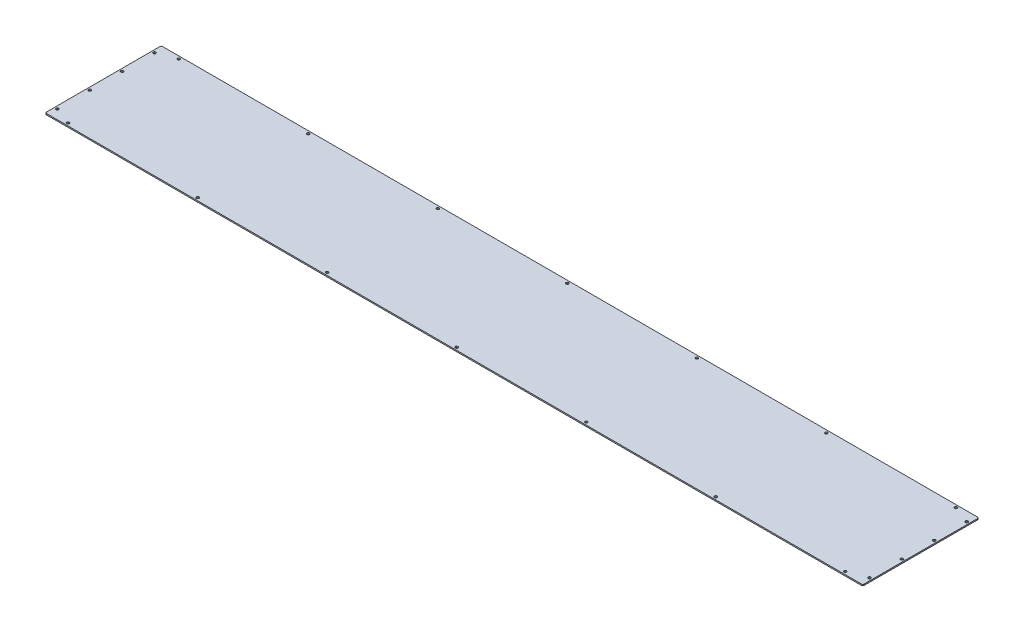
ISO-10303-21;
HEADER;
FILE_DESCRIPTION(('STEP AP214'),'2;1');
FILE_NAME('part.step','',(''),(''),'','','');
FILE_SCHEMA(('AUTOMOTIVE_DESIGN { 1 0 10303 214 1 1 1 1 }'));
ENDSEC;
DATA;
#1=APPLICATION_CONTEXT('core data for automotive mechanical design processes');
#2=APPLICATION_PROTOCOL_DEFINITION('international standard','automotive_design',2000,#1);
#3=PRODUCT_CONTEXT('',#1,'mechanical');
#4=PRODUCT('Part','Part','',(#3));
#5=PRODUCT_RELATED_PRODUCT_CATEGORY('part','',(#4));
#6=PRODUCT_DEFINITION_FORMATION('','',#4);
#7=PRODUCT_DEFINITION_CONTEXT('part definition',#1,'design');
#8=PRODUCT_DEFINITION('design','',#6,#7);
#9=PRODUCT_DEFINITION_SHAPE('','',#8);
#10=(LENGTH_UNIT() NAMED_UNIT(*) SI_UNIT(.MILLI.,.METRE.));
#11=(NAMED_UNIT(*) PLANE_ANGLE_UNIT() SI_UNIT($,.RADIAN.));
#12=(NAMED_UNIT(*) SI_UNIT($,.STERADIAN.) SOLID_ANGLE_UNIT());
#13=UNCERTAINTY_MEASURE_WITH_UNIT(LENGTH_MEASURE(1.E-05),#10,'distance_accuracy_value','');
#14=(GEOMETRIC_REPRESENTATION_CONTEXT(3) GLOBAL_UNCERTAINTY_ASSIGNED_CONTEXT((#13)) GLOBAL_UNIT_ASSIGNED_CONTEXT((#10,
#11,#12)) REPRESENTATION_CONTEXT('',''));
#15=CARTESIAN_POINT('',(0.,0.,0.));
#16=DIRECTION('',(0.,0.,1.));
#17=DIRECTION('',(1.,0.,0.));
#18=AXIS2_PLACEMENT_3D('',#15,#16,#17);
#19=CARTESIAN_POINT('',(962.025,2.9972,-136.525));
#20=DIRECTION('',(-1.,0.,0.));
#21=DIRECTION('',(0.,0.,1.));
#22=AXIS2_PLACEMENT_3D('',#19,#20,#21);
#23=PLANE('',#22);
#24=DIRECTION('',(0.,0.,-1.));
#25=VECTOR('',#24,1.);
#26=CARTESIAN_POINT('',(962.025,2.9972,-136.525));
#27=LINE('',#26,#25);
#28=CARTESIAN_POINT('',(962.025,2.9972,133.35));
#29=VERTEX_POINT('',#28);
#30=CARTESIAN_POINT('',(962.025,2.9972,-133.35));
#31=VERTEX_POINT('',#30);
#32=EDGE_CURVE('E121',#29,#31,#27,.T.);
#33=ORIENTED_EDGE('',*,*,#32,.F.);
#34=DIRECTION('',(0.,-1.,0.));
#35=VECTOR('',#34,1.);
#36=CARTESIAN_POINT('',(962.025,2.9972,133.35));
#37=LINE('',#36,#35);
#38=CARTESIAN_POINT('',(962.025,0.,133.35));
#39=VERTEX_POINT('',#38);
#40=EDGE_CURVE('E106',#29,#39,#37,.T.);
#41=ORIENTED_EDGE('',*,*,#40,.T.);
#42=DIRECTION('',(0.,0.,-1.));
#43=VECTOR('',#42,1.);
#44=CARTESIAN_POINT('',(962.025,0.,-136.525));
#45=LINE('',#44,#43);
#46=CARTESIAN_POINT('',(962.025,0.,-133.35));
#47=VERTEX_POINT('',#46);
#48=EDGE_CURVE('E118',#39,#47,#45,.T.);
#49=ORIENTED_EDGE('',*,*,#48,.T.);
#50=DIRECTION('',(0.,-1.,0.));
#51=VECTOR('',#50,1.);
#52=CARTESIAN_POINT('',(962.025,2.9972,-133.35));
#53=LINE('',#52,#51);
#54=EDGE_CURVE('E123',#47,#31,#53,.F.);
#55=ORIENTED_EDGE('',*,*,#54,.T.);
#56=EDGE_LOOP('',(#33,#41,#49,#55));
#57=FACE_BOUND('',#56,.T.);
#58=ADVANCED_FACE('F37',(#57),#23,.F.);
#59=CARTESIAN_POINT('',(-962.025,2.9972,-136.525));
#60=DIRECTION('',(0.,0.,1.));
#61=DIRECTION('',(1.,0.,0.));
#62=AXIS2_PLACEMENT_3D('',#59,#60,#61);
#63=PLANE('',#62);
#64=DIRECTION('',(-1.,0.,0.));
#65=VECTOR('',#64,1.);
#66=CARTESIAN_POINT('',(-962.025,2.9972,-136.525));
#67=LINE('',#66,#65);
#68=CARTESIAN_POINT('',(958.85,2.9972,-136.525));
#69=VERTEX_POINT('',#68);
#70=CARTESIAN_POINT('',(-958.85,2.9972,-136.525));
#71=VERTEX_POINT('',#70);
#72=EDGE_CURVE('E176',#69,#71,#67,.T.);
#73=ORIENTED_EDGE('',*,*,#72,.F.);
#74=DIRECTION('',(0.,-1.,0.));
#75=VECTOR('',#74,1.);
#76=CARTESIAN_POINT('',(958.85,2.9972,-136.525));
#77=LINE('',#76,#75);
#78=CARTESIAN_POINT('',(958.85,0.,-136.525));
#79=VERTEX_POINT('',#78);
#80=EDGE_CURVE('E160',#69,#79,#77,.T.);
#81=ORIENTED_EDGE('',*,*,#80,.T.);
#82=DIRECTION('',(-1.,0.,0.));
#83=VECTOR('',#82,1.);
#84=CARTESIAN_POINT('',(-962.025,0.,-136.525));
#85=LINE('',#84,#83);
#86=CARTESIAN_POINT('',(-958.85,0.,-136.525));
#87=VERTEX_POINT('',#86);
#88=EDGE_CURVE('E127',#79,#87,#85,.T.);
#89=ORIENTED_EDGE('',*,*,#88,.T.);
#90=DIRECTION('',(0.,-1.,0.));
#91=VECTOR('',#90,1.);
#92=CARTESIAN_POINT('',(-958.85,2.9972,-136.525));
#93=LINE('',#92,#91);
#94=EDGE_CURVE('E158',#87,#71,#93,.F.);
#95=ORIENTED_EDGE('',*,*,#94,.T.);
#96=EDGE_LOOP('',(#73,#81,#89,#95));
#97=FACE_BOUND('',#96,.T.);
#98=ADVANCED_FACE('F372',(#97),#63,.F.);
#99=CARTESIAN_POINT('',(-962.025,2.9972,-136.525));
#100=DIRECTION('',(1.,0.,0.));
#101=DIRECTION('',(0.,0.,-1.));
#102=AXIS2_PLACEMENT_3D('',#99,#100,#101);
#103=PLANE('',#102);
#104=DIRECTION('',(0.,0.,1.));
#105=VECTOR('',#104,1.);
#106=CARTESIAN_POINT('',(-962.025,0.,-136.525));
#107=LINE('',#106,#105);
#108=CARTESIAN_POINT('',(-962.025,0.,-133.35));
#109=VERTEX_POINT('',#108);
#110=CARTESIAN_POINT('',(-962.025,0.,133.35));
#111=VERTEX_POINT('',#110);
#112=EDGE_CURVE('E131',#109,#111,#107,.T.);
#113=ORIENTED_EDGE('',*,*,#112,.T.);
#114=DIRECTION('',(0.,-1.,0.));
#115=VECTOR('',#114,1.);
#116=CARTESIAN_POINT('',(-962.025,2.9972,133.35));
#117=LINE('',#116,#115);
#118=CARTESIAN_POINT('',(-962.025,2.9972,133.35));
#119=VERTEX_POINT('',#118);
#120=EDGE_CURVE('E11',#111,#119,#117,.F.);
#121=ORIENTED_EDGE('',*,*,#120,.T.);
#122=DIRECTION('',(0.,0.,1.));
#123=VECTOR('',#122,1.);
#124=CARTESIAN_POINT('',(-962.025,2.9972,-136.525));
#125=LINE('',#124,#123);
#126=CARTESIAN_POINT('',(-962.025,2.9972,-133.35));
#127=VERTEX_POINT('',#126);
#128=EDGE_CURVE('E166',#127,#119,#125,.T.);
#129=ORIENTED_EDGE('',*,*,#128,.F.);
#130=DIRECTION('',(0.,-1.,0.));
#131=VECTOR('',#130,1.);
#132=CARTESIAN_POINT('',(-962.025,2.9972,-133.35));
#133=LINE('',#132,#131);
#134=EDGE_CURVE('E45',#127,#109,#133,.T.);
#135=ORIENTED_EDGE('',*,*,#134,.T.);
#136=EDGE_LOOP('',(#113,#121,#129,#135));
#137=FACE_BOUND('',#136,.T.);
#138=ADVANCED_FACE('F165',(#137),#103,.F.);
#139=CARTESIAN_POINT('',(-962.025,2.9972,136.525));
#140=DIRECTION('',(0.,0.,-1.));
#141=DIRECTION('',(-1.,0.,0.));
#142=AXIS2_PLACEMENT_3D('',#139,#140,#141);
#143=PLANE('',#142);
#144=DIRECTION('',(1.,0.,0.));
#145=VECTOR('',#144,1.);
#146=CARTESIAN_POINT('',(-962.025,0.,136.525));
#147=LINE('',#146,#145);
#148=CARTESIAN_POINT('',(-958.85,0.,136.525));
#149=VERTEX_POINT('',#148);
#150=CARTESIAN_POINT('',(958.849999999999,0.,136.525));
#151=VERTEX_POINT('',#150);
#152=EDGE_CURVE('E141',#149,#151,#147,.T.);
#153=ORIENTED_EDGE('',*,*,#152,.T.);
#154=DIRECTION('',(0.,-1.,0.));
#155=VECTOR('',#154,1.);
#156=CARTESIAN_POINT('',(958.85,2.9972,136.525));
#157=LINE('',#156,#155);
#158=CARTESIAN_POINT('',(958.849999999999,2.9972,136.525));
#159=VERTEX_POINT('',#158);
#160=EDGE_CURVE('E107',#151,#159,#157,.F.);
#161=ORIENTED_EDGE('',*,*,#160,.T.);
#162=DIRECTION('',(1.,0.,0.));
#163=VECTOR('',#162,1.);
#164=CARTESIAN_POINT('',(-962.025,2.9972,136.525));
#165=LINE('',#164,#163);
#166=CARTESIAN_POINT('',(-958.85,2.9972,136.525));
#167=VERTEX_POINT('',#166);
#168=EDGE_CURVE('E137',#167,#159,#165,.T.);
#169=ORIENTED_EDGE('',*,*,#168,.F.);
#170=DIRECTION('',(0.,-1.,0.));
#171=VECTOR('',#170,1.);
#172=CARTESIAN_POINT('',(-958.85,2.9972,136.525));
#173=LINE('',#172,#171);
#174=EDGE_CURVE('E112',#167,#149,#173,.T.);
#175=ORIENTED_EDGE('',*,*,#174,.T.);
#176=EDGE_LOOP('',(#153,#161,#169,#175));
#177=FACE_BOUND('',#176,.T.);
#178=ADVANCED_FACE('F174',(#177),#143,.F.);
#179=CARTESIAN_POINT('',(0.,2.9972,0.));
#180=DIRECTION('',(0.,1.,0.));
#181=DIRECTION('',(0.,0.,1.));
#182=AXIS2_PLACEMENT_3D('',#179,#180,#181);
#183=PLANE('',#182);
#184=CARTESIAN_POINT('',(0.,2.9972,130.175));
#185=DIRECTION('',(0.,1.,0.));
#186=DIRECTION('',(0.,0.,1.));
#187=AXIS2_PLACEMENT_3D('',#184,#185,#186);
#188=CIRCLE('',#187,3.17499999999999);
#189=CARTESIAN_POINT('',(0.,2.9972,133.35));
#190=VERTEX_POINT('',#189);
#191=EDGE_CURVE('E305',#190,#190,#188,.T.);
#192=ORIENTED_EDGE('',*,*,#191,.F.);
#193=EDGE_LOOP('',(#192));
#194=FACE_BOUND('',#193,.T.);
#195=CARTESIAN_POINT('',(-955.675000000001,2.9972,-38.1));
#196=DIRECTION('',(0.,1.,0.));
#197=DIRECTION('',(0.,0.,1.));
#198=AXIS2_PLACEMENT_3D('',#195,#196,#197);
#199=CIRCLE('',#198,3.17500000000004);
#200=CARTESIAN_POINT('',(-955.675000000001,2.9972,-34.925));
#201=VERTEX_POINT('',#200);
#202=EDGE_CURVE('E299',#201,#201,#199,.T.);
#203=ORIENTED_EDGE('',*,*,#202,.F.);
#204=EDGE_LOOP('',(#203));
#205=FACE_BOUND('',#204,.T.);
#206=CARTESIAN_POINT('',(-955.675000000001,2.9972,38.1));
#207=DIRECTION('',(0.,1.,0.));
#208=DIRECTION('',(0.,0.,1.));
#209=AXIS2_PLACEMENT_3D('',#206,#207,#208);
#210=CIRCLE('',#209,3.17500000000004);
#211=CARTESIAN_POINT('',(-955.675000000001,2.9972,41.275));
#212=VERTEX_POINT('',#211);
#213=EDGE_CURVE('E293',#212,#212,#210,.T.);
#214=ORIENTED_EDGE('',*,*,#213,.F.);
#215=EDGE_LOOP('',(#214));
#216=FACE_BOUND('',#215,.T.);
#217=CARTESIAN_POINT('',(-914.4,2.9972,130.175));
#218=DIRECTION('',(0.,1.,0.));
#219=DIRECTION('',(0.,0.,1.));
#220=AXIS2_PLACEMENT_3D('',#217,#218,#219);
#221=CIRCLE('',#220,3.17500000000004);
#222=CARTESIAN_POINT('',(-914.4,2.9972,133.35));
#223=VERTEX_POINT('',#222);
#224=EDGE_CURVE('E287',#223,#223,#221,.T.);
#225=ORIENTED_EDGE('',*,*,#224,.F.);
#226=EDGE_LOOP('',(#225));
#227=FACE_BOUND('',#226,.T.);
#228=CARTESIAN_POINT('',(-609.6,2.9972,130.175));
#229=DIRECTION('',(0.,1.,0.));
#230=DIRECTION('',(0.,0.,1.));
#231=AXIS2_PLACEMENT_3D('',#228,#229,#230);
#232=CIRCLE('',#231,3.17500000000004);
#233=CARTESIAN_POINT('',(-609.6,2.9972,133.35));
#234=VERTEX_POINT('',#233);
#235=EDGE_CURVE('E281',#234,#234,#232,.T.);
#236=ORIENTED_EDGE('',*,*,#235,.F.);
#237=EDGE_LOOP('',(#236));
#238=FACE_BOUND('',#237,.T.);
#239=CARTESIAN_POINT('',(-304.8,2.9972,130.175));
#240=DIRECTION('',(0.,1.,0.));
#241=DIRECTION('',(0.,0.,1.));
#242=AXIS2_PLACEMENT_3D('',#239,#240,#241);
#243=CIRCLE('',#242,3.17499999999998);
#244=CARTESIAN_POINT('',(-304.8,2.9972,133.35));
#245=VERTEX_POINT('',#244);
#246=EDGE_CURVE('E275',#245,#245,#243,.T.);
#247=ORIENTED_EDGE('',*,*,#246,.F.);
#248=EDGE_LOOP('',(#247));
#249=FACE_BOUND('',#248,.T.);
#250=CARTESIAN_POINT('',(304.8,2.9972,130.175));
#251=DIRECTION('',(0.,1.,0.));
#252=DIRECTION('',(0.,0.,1.));
#253=AXIS2_PLACEMENT_3D('',#250,#251,#252);
#254=CIRCLE('',#253,3.17499999999998);
#255=CARTESIAN_POINT('',(304.8,2.9972,133.35));
#256=VERTEX_POINT('',#255);
#257=EDGE_CURVE('E269',#256,#256,#254,.T.);
#258=ORIENTED_EDGE('',*,*,#257,.F.);
#259=EDGE_LOOP('',(#258));
#260=FACE_BOUND('',#259,.T.);
#261=CARTESIAN_POINT('',(609.6,2.9972,130.175));
#262=DIRECTION('',(0.,1.,0.));
#263=DIRECTION('',(0.,0.,1.));
#264=AXIS2_PLACEMENT_3D('',#261,#262,#263);
#265=CIRCLE('',#264,3.17500000000004);
#266=CARTESIAN_POINT('',(609.6,2.9972,133.35));
#267=VERTEX_POINT('',#266);
#268=EDGE_CURVE('E263',#267,#267,#265,.T.);
#269=ORIENTED_EDGE('',*,*,#268,.F.);
#270=EDGE_LOOP('',(#269));
#271=FACE_BOUND('',#270,.T.);
#272=CARTESIAN_POINT('',(914.4,2.9972,130.175));
#273=DIRECTION('',(0.,1.,0.));
#274=DIRECTION('',(0.,0.,1.));
#275=AXIS2_PLACEMENT_3D('',#272,#273,#274);
#276=CIRCLE('',#275,3.17500000000004);
#277=CARTESIAN_POINT('',(914.4,2.9972,133.35));
#278=VERTEX_POINT('',#277);
#279=EDGE_CURVE('E257',#278,#278,#276,.T.);
#280=ORIENTED_EDGE('',*,*,#279,.F.);
#281=EDGE_LOOP('',(#280));
#282=FACE_BOUND('',#281,.T.);
#283=CARTESIAN_POINT('',(-955.675000000001,2.9972,114.3));
#284=DIRECTION('',(0.,1.,0.));
#285=DIRECTION('',(0.,0.,1.));
#286=AXIS2_PLACEMENT_3D('',#283,#284,#285);
#287=CIRCLE('',#286,3.17500000000004);
#288=CARTESIAN_POINT('',(-955.675000000001,2.9972,117.475));
#289=VERTEX_POINT('',#288);
#290=EDGE_CURVE('E251',#289,#289,#287,.T.);
#291=ORIENTED_EDGE('',*,*,#290,.F.);
#292=EDGE_LOOP('',(#291));
#293=FACE_BOUND('',#292,.T.);
#294=CARTESIAN_POINT('',(914.4,2.9972,-130.175));
#295=DIRECTION('',(0.,1.,0.));
#296=DIRECTION('',(0.,0.,1.));
#297=AXIS2_PLACEMENT_3D('',#294,#295,#296);
#298=CIRCLE('',#297,3.17500000000004);
#299=CARTESIAN_POINT('',(914.4,2.9972,-127.));
#300=VERTEX_POINT('',#299);
#301=EDGE_CURVE('E245',#300,#300,#298,.T.);
#302=ORIENTED_EDGE('',*,*,#301,.F.);
#303=EDGE_LOOP('',(#302));
#304=FACE_BOUND('',#303,.T.);
#305=CARTESIAN_POINT('',(609.6,2.9972,-130.175));
#306=DIRECTION('',(0.,1.,0.));
#307=DIRECTION('',(0.,0.,1.));
#308=AXIS2_PLACEMENT_3D('',#305,#306,#307);
#309=CIRCLE('',#308,3.17500000000004);
#310=CARTESIAN_POINT('',(609.6,2.9972,-127.));
#311=VERTEX_POINT('',#310);
#312=EDGE_CURVE('E239',#311,#311,#309,.T.);
#313=ORIENTED_EDGE('',*,*,#312,.F.);
#314=EDGE_LOOP('',(#313));
#315=FACE_BOUND('',#314,.T.);
#316=CARTESIAN_POINT('',(304.8,2.9972,-130.175));
#317=DIRECTION('',(0.,1.,0.));
#318=DIRECTION('',(0.,0.,1.));
#319=AXIS2_PLACEMENT_3D('',#316,#317,#318);
#320=CIRCLE('',#319,3.17499999999998);
#321=CARTESIAN_POINT('',(304.8,2.9972,-127.));
#322=VERTEX_POINT('',#321);
#323=EDGE_CURVE('E233',#322,#322,#320,.T.);
#324=ORIENTED_EDGE('',*,*,#323,.F.);
#325=EDGE_LOOP('',(#324));
#326=FACE_BOUND('',#325,.T.);
#327=CARTESIAN_POINT('',(-304.8,2.9972,-130.175));
#328=DIRECTION('',(0.,1.,0.));
#329=DIRECTION('',(0.,0.,1.));
#330=AXIS2_PLACEMENT_3D('',#327,#328,#329);
#331=CIRCLE('',#330,3.17499999999998);
#332=CARTESIAN_POINT('',(-304.8,2.9972,-127.));
#333=VERTEX_POINT('',#332);
#334=EDGE_CURVE('E227',#333,#333,#331,.T.);
#335=ORIENTED_EDGE('',*,*,#334,.F.);
#336=EDGE_LOOP('',(#335));
#337=FACE_BOUND('',#336,.T.);
#338=CARTESIAN_POINT('',(-609.6,2.9972,-130.175));
#339=DIRECTION('',(0.,1.,0.));
#340=DIRECTION('',(0.,0.,1.));
#341=AXIS2_PLACEMENT_3D('',#338,#339,#340);
#342=CIRCLE('',#341,3.17500000000004);
#343=CARTESIAN_POINT('',(-609.6,2.9972,-127.));
#344=VERTEX_POINT('',#343);
#345=EDGE_CURVE('E221',#344,#344,#342,.T.);
#346=ORIENTED_EDGE('',*,*,#345,.F.);
#347=EDGE_LOOP('',(#346));
#348=FACE_BOUND('',#347,.T.);
#349=CARTESIAN_POINT('',(-914.4,2.9972,-130.175));
#350=DIRECTION('',(0.,1.,0.));
#351=DIRECTION('',(0.,0.,1.));
#352=AXIS2_PLACEMENT_3D('',#349,#350,#351);
#353=CIRCLE('',#352,3.17500000000004);
#354=CARTESIAN_POINT('',(-914.4,2.9972,-127.));
#355=VERTEX_POINT('',#354);
#356=EDGE_CURVE('E215',#355,#355,#353,.T.);
#357=ORIENTED_EDGE('',*,*,#356,.F.);
#358=EDGE_LOOP('',(#357));
#359=FACE_BOUND('',#358,.T.);
#360=CARTESIAN_POINT('',(0.,2.9972,-130.175));
#361=DIRECTION('',(0.,1.,0.));
#362=DIRECTION('',(0.,0.,1.));
#363=AXIS2_PLACEMENT_3D('',#360,#361,#362);
#364=CIRCLE('',#363,3.17499999999999);
#365=CARTESIAN_POINT('',(0.,2.9972,-127.));
#366=VERTEX_POINT('',#365);
#367=EDGE_CURVE('E209',#366,#366,#364,.T.);
#368=ORIENTED_EDGE('',*,*,#367,.F.);
#369=EDGE_LOOP('',(#368));
#370=FACE_BOUND('',#369,.T.);
#371=CARTESIAN_POINT('',(955.675000000001,2.9972,114.3));
#372=DIRECTION('',(0.,1.,0.));
#373=DIRECTION('',(0.,0.,1.));
#374=AXIS2_PLACEMENT_3D('',#371,#372,#373);
#375=CIRCLE('',#374,3.17500000000004);
#376=CARTESIAN_POINT('',(955.675000000001,2.9972,117.475));
#377=VERTEX_POINT('',#376);
#378=EDGE_CURVE('E203',#377,#377,#375,.T.);
#379=ORIENTED_EDGE('',*,*,#378,.F.);
#380=EDGE_LOOP('',(#379));
#381=FACE_BOUND('',#380,.T.);
#382=CARTESIAN_POINT('',(955.675000000001,2.9972,38.0999999999998));
#383=DIRECTION('',(0.,1.,0.));
#384=DIRECTION('',(0.,0.,1.));
#385=AXIS2_PLACEMENT_3D('',#382,#383,#384);
#386=CIRCLE('',#385,3.17500000000004);
#387=CARTESIAN_POINT('',(955.675000000001,2.9972,41.2749999999998));
#388=VERTEX_POINT('',#387);
#389=EDGE_CURVE('E197',#388,#388,#386,.T.);
#390=ORIENTED_EDGE('',*,*,#389,.F.);
#391=EDGE_LOOP('',(#390));
#392=FACE_BOUND('',#391,.T.);
#393=CARTESIAN_POINT('',(955.675000000001,2.9972,-38.1000000000003));
#394=DIRECTION('',(0.,1.,0.));
#395=DIRECTION('',(0.,0.,1.));
#396=AXIS2_PLACEMENT_3D('',#393,#394,#395);
#397=CIRCLE('',#396,3.17500000000004);
#398=CARTESIAN_POINT('',(955.675000000001,2.9972,-34.9250000000002));
#399=VERTEX_POINT('',#398);
#400=EDGE_CURVE('E191',#399,#399,#397,.T.);
#401=ORIENTED_EDGE('',*,*,#400,.F.);
#402=EDGE_LOOP('',(#401));
#403=FACE_BOUND('',#402,.T.);
#404=CARTESIAN_POINT('',(-955.675000000001,2.9972,-114.3));
#405=DIRECTION('',(0.,1.,0.));
#406=DIRECTION('',(0.,0.,1.));
#407=AXIS2_PLACEMENT_3D('',#404,#405,#406);
#408=CIRCLE('',#407,3.17500000000004);
#409=CARTESIAN_POINT('',(-955.675000000001,2.9972,-111.125));
#410=VERTEX_POINT('',#409);
#411=EDGE_CURVE('E185',#410,#410,#408,.T.);
#412=ORIENTED_EDGE('',*,*,#411,.F.);
#413=EDGE_LOOP('',(#412));
#414=FACE_BOUND('',#413,.T.);
#415=CARTESIAN_POINT('',(955.675000000001,2.9972,-114.3));
#416=DIRECTION('',(0.,1.,0.));
#417=DIRECTION('',(0.,0.,1.));
#418=AXIS2_PLACEMENT_3D('',#415,#416,#417);
#419=CIRCLE('',#418,3.17500000000004);
#420=CARTESIAN_POINT('',(955.675000000001,2.9972,-111.125));
#421=VERTEX_POINT('',#420);
#422=EDGE_CURVE('E134',#421,#421,#419,.T.);
#423=ORIENTED_EDGE('',*,*,#422,.F.);
#424=EDGE_LOOP('',(#423));
#425=FACE_BOUND('',#424,.T.);
#426=ORIENTED_EDGE('',*,*,#168,.T.);
#427=CARTESIAN_POINT('',(958.85,2.9972,133.35));
#428=DIRECTION('',(0.,1.,0.));
#429=DIRECTION('',(0.,0.,1.));
#430=AXIS2_PLACEMENT_3D('',#427,#428,#429);
#431=CIRCLE('',#430,3.175);
#432=EDGE_CURVE('E156',#159,#29,#431,.T.);
#433=ORIENTED_EDGE('',*,*,#432,.T.);
#434=ORIENTED_EDGE('',*,*,#32,.T.);
#435=CARTESIAN_POINT('',(958.85,2.9972,-133.35));
#436=DIRECTION('',(0.,1.,0.));
#437=DIRECTION('',(0.,0.,1.));
#438=AXIS2_PLACEMENT_3D('',#435,#436,#437);
#439=CIRCLE('',#438,3.175);
#440=EDGE_CURVE('E154',#31,#69,#439,.T.);
#441=ORIENTED_EDGE('',*,*,#440,.T.);
#442=ORIENTED_EDGE('',*,*,#72,.T.);
#443=CARTESIAN_POINT('',(-958.85,2.9972,-133.35));
#444=DIRECTION('',(0.,1.,0.));
#445=DIRECTION('',(0.,0.,1.));
#446=AXIS2_PLACEMENT_3D('',#443,#444,#445);
#447=CIRCLE('',#446,3.175);
#448=EDGE_CURVE('E57',#71,#127,#447,.T.);
#449=ORIENTED_EDGE('',*,*,#448,.T.);
#450=ORIENTED_EDGE('',*,*,#128,.T.);
#451=CARTESIAN_POINT('',(-958.85,2.9972,133.35));
#452=DIRECTION('',(0.,1.,0.));
#453=DIRECTION('',(0.,0.,1.));
#454=AXIS2_PLACEMENT_3D('',#451,#452,#453);
#455=CIRCLE('',#454,3.175);
#456=EDGE_CURVE('E152',#119,#167,#455,.T.);
#457=ORIENTED_EDGE('',*,*,#456,.T.);
#458=EDGE_LOOP('',(#426,#433,#434,#441,#442,#449,#450,#457));
#459=FACE_BOUND('',#458,.T.);
#460=ADVANCED_FACE('F311',(#194,#205,#216,#227,#238,#249,#260,#271,#282,#293,#304,#315,#326,
#337,#348,#359,#370,#381,#392,#403,#414,#425,#459),#183,.T.);
#461=CARTESIAN_POINT('',(0.,0.,0.));
#462=DIRECTION('',(0.,1.,0.));
#463=DIRECTION('',(0.,0.,1.));
#464=AXIS2_PLACEMENT_3D('',#461,#462,#463);
#465=PLANE('',#464);
#466=CARTESIAN_POINT('',(0.,0.,130.175));
#467=DIRECTION('',(0.,1.,0.));
#468=DIRECTION('',(0.,0.,1.));
#469=AXIS2_PLACEMENT_3D('',#466,#467,#468);
#470=CIRCLE('',#469,3.175);
#471=CARTESIAN_POINT('',(0.,0.,133.35));
#472=VERTEX_POINT('',#471);
#473=EDGE_CURVE('E302',#472,#472,#470,.T.);
#474=ORIENTED_EDGE('',*,*,#473,.T.);
#475=EDGE_LOOP('',(#474));
#476=FACE_BOUND('',#475,.T.);
#477=CARTESIAN_POINT('',(-955.675000000001,0.,-38.1));
#478=DIRECTION('',(0.,1.,0.));
#479=DIRECTION('',(0.,0.,1.));
#480=AXIS2_PLACEMENT_3D('',#477,#478,#479);
#481=CIRCLE('',#480,3.17500000000004);
#482=CARTESIAN_POINT('',(-955.675000000001,0.,-34.925));
#483=VERTEX_POINT('',#482);
#484=EDGE_CURVE('E296',#483,#483,#481,.T.);
#485=ORIENTED_EDGE('',*,*,#484,.T.);
#486=EDGE_LOOP('',(#485));
#487=FACE_BOUND('',#486,.T.);
#488=CARTESIAN_POINT('',(-955.675000000001,0.,38.1));
#489=DIRECTION('',(0.,1.,0.));
#490=DIRECTION('',(0.,0.,1.));
#491=AXIS2_PLACEMENT_3D('',#488,#489,#490);
#492=CIRCLE('',#491,3.17500000000004);
#493=CARTESIAN_POINT('',(-955.675000000001,0.,41.275));
#494=VERTEX_POINT('',#493);
#495=EDGE_CURVE('E290',#494,#494,#492,.T.);
#496=ORIENTED_EDGE('',*,*,#495,.T.);
#497=EDGE_LOOP('',(#496));
#498=FACE_BOUND('',#497,.T.);
#499=CARTESIAN_POINT('',(-914.4,0.,130.175));
#500=DIRECTION('',(0.,1.,0.));
#501=DIRECTION('',(0.,0.,1.));
#502=AXIS2_PLACEMENT_3D('',#499,#500,#501);
#503=CIRCLE('',#502,3.17500000000004);
#504=CARTESIAN_POINT('',(-914.4,0.,133.35));
#505=VERTEX_POINT('',#504);
#506=EDGE_CURVE('E284',#505,#505,#503,.T.);
#507=ORIENTED_EDGE('',*,*,#506,.T.);
#508=EDGE_LOOP('',(#507));
#509=FACE_BOUND('',#508,.T.);
#510=CARTESIAN_POINT('',(-609.6,0.,130.175));
#511=DIRECTION('',(0.,1.,0.));
#512=DIRECTION('',(0.,0.,1.));
#513=AXIS2_PLACEMENT_3D('',#510,#511,#512);
#514=CIRCLE('',#513,3.17500000000004);
#515=CARTESIAN_POINT('',(-609.6,0.,133.35));
#516=VERTEX_POINT('',#515);
#517=EDGE_CURVE('E278',#516,#516,#514,.T.);
#518=ORIENTED_EDGE('',*,*,#517,.T.);
#519=EDGE_LOOP('',(#518));
#520=FACE_BOUND('',#519,.T.);
#521=CARTESIAN_POINT('',(-304.8,0.,130.175));
#522=DIRECTION('',(0.,1.,0.));
#523=DIRECTION('',(0.,0.,1.));
#524=AXIS2_PLACEMENT_3D('',#521,#522,#523);
#525=CIRCLE('',#524,3.17499999999998);
#526=CARTESIAN_POINT('',(-304.8,0.,133.35));
#527=VERTEX_POINT('',#526);
#528=EDGE_CURVE('E272',#527,#527,#525,.T.);
#529=ORIENTED_EDGE('',*,*,#528,.T.);
#530=EDGE_LOOP('',(#529));
#531=FACE_BOUND('',#530,.T.);
#532=CARTESIAN_POINT('',(304.8,0.,130.175));
#533=DIRECTION('',(0.,1.,0.));
#534=DIRECTION('',(0.,0.,1.));
#535=AXIS2_PLACEMENT_3D('',#532,#533,#534);
#536=CIRCLE('',#535,3.17499999999998);
#537=CARTESIAN_POINT('',(304.8,0.,133.35));
#538=VERTEX_POINT('',#537);
#539=EDGE_CURVE('E266',#538,#538,#536,.T.);
#540=ORIENTED_EDGE('',*,*,#539,.T.);
#541=EDGE_LOOP('',(#540));
#542=FACE_BOUND('',#541,.T.);
#543=CARTESIAN_POINT('',(609.6,0.,130.175));
#544=DIRECTION('',(0.,1.,0.));
#545=DIRECTION('',(0.,0.,1.));
#546=AXIS2_PLACEMENT_3D('',#543,#544,#545);
#547=CIRCLE('',#546,3.17500000000004);
#548=CARTESIAN_POINT('',(609.6,0.,133.35));
#549=VERTEX_POINT('',#548);
#550=EDGE_CURVE('E260',#549,#549,#547,.T.);
#551=ORIENTED_EDGE('',*,*,#550,.T.);
#552=EDGE_LOOP('',(#551));
#553=FACE_BOUND('',#552,.T.);
#554=CARTESIAN_POINT('',(914.4,0.,130.175));
#555=DIRECTION('',(0.,1.,0.));
#556=DIRECTION('',(0.,0.,1.));
#557=AXIS2_PLACEMENT_3D('',#554,#555,#556);
#558=CIRCLE('',#557,3.17500000000004);
#559=CARTESIAN_POINT('',(914.4,0.,133.35));
#560=VERTEX_POINT('',#559);
#561=EDGE_CURVE('E254',#560,#560,#558,.T.);
#562=ORIENTED_EDGE('',*,*,#561,.T.);
#563=EDGE_LOOP('',(#562));
#564=FACE_BOUND('',#563,.T.);
#565=CARTESIAN_POINT('',(-955.675000000001,0.,114.3));
#566=DIRECTION('',(0.,1.,0.));
#567=DIRECTION('',(0.,0.,1.));
#568=AXIS2_PLACEMENT_3D('',#565,#566,#567);
#569=CIRCLE('',#568,3.17500000000004);
#570=CARTESIAN_POINT('',(-955.675000000001,0.,117.475));
#571=VERTEX_POINT('',#570);
#572=EDGE_CURVE('E248',#571,#571,#569,.T.);
#573=ORIENTED_EDGE('',*,*,#572,.T.);
#574=EDGE_LOOP('',(#573));
#575=FACE_BOUND('',#574,.T.);
#576=CARTESIAN_POINT('',(914.4,0.,-130.175));
#577=DIRECTION('',(0.,1.,0.));
#578=DIRECTION('',(0.,0.,1.));
#579=AXIS2_PLACEMENT_3D('',#576,#577,#578);
#580=CIRCLE('',#579,3.17500000000004);
#581=CARTESIAN_POINT('',(914.4,0.,-127.));
#582=VERTEX_POINT('',#581);
#583=EDGE_CURVE('E242',#582,#582,#580,.T.);
#584=ORIENTED_EDGE('',*,*,#583,.T.);
#585=EDGE_LOOP('',(#584));
#586=FACE_BOUND('',#585,.T.);
#587=CARTESIAN_POINT('',(609.6,0.,-130.175));
#588=DIRECTION('',(0.,1.,0.));
#589=DIRECTION('',(0.,0.,1.));
#590=AXIS2_PLACEMENT_3D('',#587,#588,#589);
#591=CIRCLE('',#590,3.17500000000004);
#592=CARTESIAN_POINT('',(609.6,0.,-127.));
#593=VERTEX_POINT('',#592);
#594=EDGE_CURVE('E236',#593,#593,#591,.T.);
#595=ORIENTED_EDGE('',*,*,#594,.T.);
#596=EDGE_LOOP('',(#595));
#597=FACE_BOUND('',#596,.T.);
#598=CARTESIAN_POINT('',(304.8,0.,-130.175));
#599=DIRECTION('',(0.,1.,0.));
#600=DIRECTION('',(0.,0.,1.));
#601=AXIS2_PLACEMENT_3D('',#598,#599,#600);
#602=CIRCLE('',#601,3.17499999999998);
#603=CARTESIAN_POINT('',(304.8,0.,-127.));
#604=VERTEX_POINT('',#603);
#605=EDGE_CURVE('E230',#604,#604,#602,.T.);
#606=ORIENTED_EDGE('',*,*,#605,.T.);
#607=EDGE_LOOP('',(#606));
#608=FACE_BOUND('',#607,.T.);
#609=CARTESIAN_POINT('',(-304.8,0.,-130.175));
#610=DIRECTION('',(0.,1.,0.));
#611=DIRECTION('',(0.,0.,1.));
#612=AXIS2_PLACEMENT_3D('',#609,#610,#611);
#613=CIRCLE('',#612,3.17499999999998);
#614=CARTESIAN_POINT('',(-304.8,0.,-127.));
#615=VERTEX_POINT('',#614);
#616=EDGE_CURVE('E224',#615,#615,#613,.T.);
#617=ORIENTED_EDGE('',*,*,#616,.T.);
#618=EDGE_LOOP('',(#617));
#619=FACE_BOUND('',#618,.T.);
#620=CARTESIAN_POINT('',(-609.6,0.,-130.175));
#621=DIRECTION('',(0.,1.,0.));
#622=DIRECTION('',(0.,0.,1.));
#623=AXIS2_PLACEMENT_3D('',#620,#621,#622);
#624=CIRCLE('',#623,3.17500000000004);
#625=CARTESIAN_POINT('',(-609.6,0.,-127.));
#626=VERTEX_POINT('',#625);
#627=EDGE_CURVE('E218',#626,#626,#624,.T.);
#628=ORIENTED_EDGE('',*,*,#627,.T.);
#629=EDGE_LOOP('',(#628));
#630=FACE_BOUND('',#629,.T.);
#631=CARTESIAN_POINT('',(-914.4,0.,-130.175));
#632=DIRECTION('',(0.,1.,0.));
#633=DIRECTION('',(0.,0.,1.));
#634=AXIS2_PLACEMENT_3D('',#631,#632,#633);
#635=CIRCLE('',#634,3.17500000000004);
#636=CARTESIAN_POINT('',(-914.4,0.,-127.));
#637=VERTEX_POINT('',#636);
#638=EDGE_CURVE('E212',#637,#637,#635,.T.);
#639=ORIENTED_EDGE('',*,*,#638,.T.);
#640=EDGE_LOOP('',(#639));
#641=FACE_BOUND('',#640,.T.);
#642=CARTESIAN_POINT('',(0.,0.,-130.175));
#643=DIRECTION('',(0.,1.,0.));
#644=DIRECTION('',(0.,0.,1.));
#645=AXIS2_PLACEMENT_3D('',#642,#643,#644);
#646=CIRCLE('',#645,3.175);
#647=CARTESIAN_POINT('',(0.,0.,-127.));
#648=VERTEX_POINT('',#647);
#649=EDGE_CURVE('E206',#648,#648,#646,.T.);
#650=ORIENTED_EDGE('',*,*,#649,.T.);
#651=EDGE_LOOP('',(#650));
#652=FACE_BOUND('',#651,.T.);
#653=CARTESIAN_POINT('',(955.675000000001,0.,114.3));
#654=DIRECTION('',(0.,1.,0.));
#655=DIRECTION('',(0.,0.,1.));
#656=AXIS2_PLACEMENT_3D('',#653,#654,#655);
#657=CIRCLE('',#656,3.17500000000004);
#658=CARTESIAN_POINT('',(955.675000000001,0.,117.475));
#659=VERTEX_POINT('',#658);
#660=EDGE_CURVE('E200',#659,#659,#657,.T.);
#661=ORIENTED_EDGE('',*,*,#660,.T.);
#662=EDGE_LOOP('',(#661));
#663=FACE_BOUND('',#662,.T.);
#664=CARTESIAN_POINT('',(955.675000000001,0.,38.0999999999998));
#665=DIRECTION('',(0.,1.,0.));
#666=DIRECTION('',(0.,0.,1.));
#667=AXIS2_PLACEMENT_3D('',#664,#665,#666);
#668=CIRCLE('',#667,3.17500000000004);
#669=CARTESIAN_POINT('',(955.675000000001,0.,41.2749999999998));
#670=VERTEX_POINT('',#669);
#671=EDGE_CURVE('E194',#670,#670,#668,.T.);
#672=ORIENTED_EDGE('',*,*,#671,.T.);
#673=EDGE_LOOP('',(#672));
#674=FACE_BOUND('',#673,.T.);
#675=CARTESIAN_POINT('',(955.675000000001,0.,-38.1000000000003));
#676=DIRECTION('',(0.,1.,0.));
#677=DIRECTION('',(0.,0.,1.));
#678=AXIS2_PLACEMENT_3D('',#675,#676,#677);
#679=CIRCLE('',#678,3.17500000000004);
#680=CARTESIAN_POINT('',(955.675000000001,0.,-34.9250000000002));
#681=VERTEX_POINT('',#680);
#682=EDGE_CURVE('E188',#681,#681,#679,.T.);
#683=ORIENTED_EDGE('',*,*,#682,.T.);
#684=EDGE_LOOP('',(#683));
#685=FACE_BOUND('',#684,.T.);
#686=CARTESIAN_POINT('',(-955.675000000001,0.,-114.3));
#687=DIRECTION('',(0.,1.,0.));
#688=DIRECTION('',(0.,0.,1.));
#689=AXIS2_PLACEMENT_3D('',#686,#687,#688);
#690=CIRCLE('',#689,3.17500000000004);
#691=CARTESIAN_POINT('',(-955.675000000001,0.,-111.125));
#692=VERTEX_POINT('',#691);
#693=EDGE_CURVE('E182',#692,#692,#690,.T.);
#694=ORIENTED_EDGE('',*,*,#693,.T.);
#695=EDGE_LOOP('',(#694));
#696=FACE_BOUND('',#695,.T.);
#697=CARTESIAN_POINT('',(955.675000000001,0.,-114.3));
#698=DIRECTION('',(0.,1.,0.));
#699=DIRECTION('',(0.,0.,1.));
#700=AXIS2_PLACEMENT_3D('',#697,#698,#699);
#701=CIRCLE('',#700,3.17500000000004);
#702=CARTESIAN_POINT('',(955.675000000001,0.,-111.125));
#703=VERTEX_POINT('',#702);
#704=EDGE_CURVE('E128',#703,#703,#701,.T.);
#705=ORIENTED_EDGE('',*,*,#704,.T.);
#706=EDGE_LOOP('',(#705));
#707=FACE_BOUND('',#706,.T.);
#708=ORIENTED_EDGE('',*,*,#48,.F.);
#709=CARTESIAN_POINT('',(958.85,0.,133.35));
#710=DIRECTION('',(0.,1.,0.));
#711=DIRECTION('',(0.,0.,1.));
#712=AXIS2_PLACEMENT_3D('',#709,#710,#711);
#713=CIRCLE('',#712,3.175);
#714=EDGE_CURVE('E102',#39,#151,#713,.F.);
#715=ORIENTED_EDGE('',*,*,#714,.T.);
#716=ORIENTED_EDGE('',*,*,#152,.F.);
#717=CARTESIAN_POINT('',(-958.85,0.,133.35));
#718=DIRECTION('',(0.,1.,0.));
#719=DIRECTION('',(0.,0.,1.));
#720=AXIS2_PLACEMENT_3D('',#717,#718,#719);
#721=CIRCLE('',#720,3.175);
#722=EDGE_CURVE('E145',#149,#111,#721,.F.);
#723=ORIENTED_EDGE('',*,*,#722,.T.);
#724=ORIENTED_EDGE('',*,*,#112,.F.);
#725=CARTESIAN_POINT('',(-958.85,0.,-133.35));
#726=DIRECTION('',(0.,1.,0.));
#727=DIRECTION('',(0.,0.,1.));
#728=AXIS2_PLACEMENT_3D('',#725,#726,#727);
#729=CIRCLE('',#728,3.175);
#730=EDGE_CURVE('E122',#109,#87,#729,.F.);
#731=ORIENTED_EDGE('',*,*,#730,.T.);
#732=ORIENTED_EDGE('',*,*,#88,.F.);
#733=CARTESIAN_POINT('',(958.85,0.,-133.35));
#734=DIRECTION('',(0.,1.,0.));
#735=DIRECTION('',(0.,0.,1.));
#736=AXIS2_PLACEMENT_3D('',#733,#734,#735);
#737=CIRCLE('',#736,3.175);
#738=EDGE_CURVE('E113',#79,#47,#737,.F.);
#739=ORIENTED_EDGE('',*,*,#738,.T.);
#740=EDGE_LOOP('',(#708,#715,#716,#723,#724,#731,#732,#739));
#741=FACE_BOUND('',#740,.T.);
#742=ADVANCED_FACE('F125',(#476,#487,#498,#509,#520,#531,#542,#553,#564,#575,#586,#597,#608,
#619,#630,#641,#652,#663,#674,#685,#696,#707,#741),#465,.F.);
#743=CARTESIAN_POINT('',(958.85,2.9972,133.35));
#744=DIRECTION('',(0.,-1.,0.));
#745=DIRECTION('',(0.,0.,-1.));
#746=AXIS2_PLACEMENT_3D('',#743,#744,#745);
#747=CYLINDRICAL_SURFACE('',#746,3.175);
#748=ORIENTED_EDGE('',*,*,#432,.F.);
#749=ORIENTED_EDGE('',*,*,#160,.F.);
#750=ORIENTED_EDGE('',*,*,#714,.F.);
#751=ORIENTED_EDGE('',*,*,#40,.F.);
#752=EDGE_LOOP('',(#748,#749,#750,#751));
#753=FACE_BOUND('',#752,.T.);
#754=ADVANCED_FACE('F105',(#753),#747,.T.);
#755=CARTESIAN_POINT('',(958.85,2.9972,-133.35));
#756=DIRECTION('',(0.,-1.,0.));
#757=DIRECTION('',(0.,0.,-1.));
#758=AXIS2_PLACEMENT_3D('',#755,#756,#757);
#759=CYLINDRICAL_SURFACE('',#758,3.175);
#760=ORIENTED_EDGE('',*,*,#440,.F.);
#761=ORIENTED_EDGE('',*,*,#54,.F.);
#762=ORIENTED_EDGE('',*,*,#738,.F.);
#763=ORIENTED_EDGE('',*,*,#80,.F.);
#764=EDGE_LOOP('',(#760,#761,#762,#763));
#765=FACE_BOUND('',#764,.T.);
#766=ADVANCED_FACE('F383',(#765),#759,.T.);
#767=CARTESIAN_POINT('',(-958.85,2.9972,133.35));
#768=DIRECTION('',(0.,-1.,0.));
#769=DIRECTION('',(0.,0.,-1.));
#770=AXIS2_PLACEMENT_3D('',#767,#768,#769);
#771=CYLINDRICAL_SURFACE('',#770,3.175);
#772=ORIENTED_EDGE('',*,*,#456,.F.);
#773=ORIENTED_EDGE('',*,*,#120,.F.);
#774=ORIENTED_EDGE('',*,*,#722,.F.);
#775=ORIENTED_EDGE('',*,*,#174,.F.);
#776=EDGE_LOOP('',(#772,#773,#774,#775));
#777=FACE_BOUND('',#776,.T.);
#778=ADVANCED_FACE('F171',(#777),#771,.T.);
#779=CARTESIAN_POINT('',(-958.85,2.9972,-133.35));
#780=DIRECTION('',(0.,-1.,0.));
#781=DIRECTION('',(0.,0.,-1.));
#782=AXIS2_PLACEMENT_3D('',#779,#780,#781);
#783=CYLINDRICAL_SURFACE('',#782,3.175);
#784=ORIENTED_EDGE('',*,*,#448,.F.);
#785=ORIENTED_EDGE('',*,*,#94,.F.);
#786=ORIENTED_EDGE('',*,*,#730,.F.);
#787=ORIENTED_EDGE('',*,*,#134,.F.);
#788=EDGE_LOOP('',(#784,#785,#786,#787));
#789=FACE_BOUND('',#788,.T.);
#790=ADVANCED_FACE('F39',(#789),#783,.T.);
#791=CARTESIAN_POINT('',(955.675000000001,2.9972,-114.3));
#792=DIRECTION('',(0.,1.,0.));
#793=DIRECTION('',(0.,0.,1.));
#794=AXIS2_PLACEMENT_3D('',#791,#792,#793);
#795=CYLINDRICAL_SURFACE('',#794,3.17500000000004);
#796=ORIENTED_EDGE('',*,*,#704,.F.);
#797=EDGE_LOOP('',(#796));
#798=FACE_BOUND('',#797,.T.);
#799=ORIENTED_EDGE('',*,*,#422,.T.);
#800=EDGE_LOOP('',(#799));
#801=FACE_BOUND('',#800,.T.);
#802=ADVANCED_FACE('F357',(#798,#801),#795,.F.);
#803=CARTESIAN_POINT('',(-955.675000000001,2.9972,-114.3));
#804=DIRECTION('',(0.,1.,0.));
#805=DIRECTION('',(0.,0.,1.));
#806=AXIS2_PLACEMENT_3D('',#803,#804,#805);
#807=CYLINDRICAL_SURFACE('',#806,3.17500000000004);
#808=ORIENTED_EDGE('',*,*,#693,.F.);
#809=EDGE_LOOP('',(#808));
#810=FACE_BOUND('',#809,.T.);
#811=ORIENTED_EDGE('',*,*,#411,.T.);
#812=EDGE_LOOP('',(#811));
#813=FACE_BOUND('',#812,.T.);
#814=ADVANCED_FACE('F359',(#810,#813),#807,.F.);
#815=CARTESIAN_POINT('',(955.675000000001,2.9972,-38.1000000000003));
#816=DIRECTION('',(0.,1.,0.));
#817=DIRECTION('',(0.,0.,1.));
#818=AXIS2_PLACEMENT_3D('',#815,#816,#817);
#819=CYLINDRICAL_SURFACE('',#818,3.17500000000004);
#820=ORIENTED_EDGE('',*,*,#682,.F.);
#821=EDGE_LOOP('',(#820));
#822=FACE_BOUND('',#821,.T.);
#823=ORIENTED_EDGE('',*,*,#400,.T.);
#824=EDGE_LOOP('',(#823));
#825=FACE_BOUND('',#824,.T.);
#826=ADVANCED_FACE('F366',(#822,#825),#819,.F.);
#827=CARTESIAN_POINT('',(955.675000000001,2.9972,38.0999999999998));
#828=DIRECTION('',(0.,1.,0.));
#829=DIRECTION('',(0.,0.,1.));
#830=AXIS2_PLACEMENT_3D('',#827,#828,#829);
#831=CYLINDRICAL_SURFACE('',#830,3.17500000000004);
#832=ORIENTED_EDGE('',*,*,#671,.F.);
#833=EDGE_LOOP('',(#832));
#834=FACE_BOUND('',#833,.T.);
#835=ORIENTED_EDGE('',*,*,#389,.T.);
#836=EDGE_LOOP('',(#835));
#837=FACE_BOUND('',#836,.T.);
#838=ADVANCED_FACE('F476',(#834,#837),#831,.F.);
#839=CARTESIAN_POINT('',(955.675000000001,2.9972,114.3));
#840=DIRECTION('',(0.,1.,0.));
#841=DIRECTION('',(0.,0.,1.));
#842=AXIS2_PLACEMENT_3D('',#839,#840,#841);
#843=CYLINDRICAL_SURFACE('',#842,3.17500000000004);
#844=ORIENTED_EDGE('',*,*,#660,.F.);
#845=EDGE_LOOP('',(#844));
#846=FACE_BOUND('',#845,.T.);
#847=ORIENTED_EDGE('',*,*,#378,.T.);
#848=EDGE_LOOP('',(#847));
#849=FACE_BOUND('',#848,.T.);
#850=ADVANCED_FACE('F481',(#846,#849),#843,.F.);
#851=CARTESIAN_POINT('',(0.,2.9972,-130.175));
#852=DIRECTION('',(0.,1.,0.));
#853=DIRECTION('',(0.,0.,1.));
#854=AXIS2_PLACEMENT_3D('',#851,#852,#853);
#855=CYLINDRICAL_SURFACE('',#854,3.17499999999999);
#856=ORIENTED_EDGE('',*,*,#649,.F.);
#857=EDGE_LOOP('',(#856));
#858=FACE_BOUND('',#857,.T.);
#859=ORIENTED_EDGE('',*,*,#367,.T.);
#860=EDGE_LOOP('',(#859));
#861=FACE_BOUND('',#860,.T.);
#862=ADVANCED_FACE('F487',(#858,#861),#855,.F.);
#863=CARTESIAN_POINT('',(-914.4,2.9972,-130.175));
#864=DIRECTION('',(0.,1.,0.));
#865=DIRECTION('',(0.,0.,1.));
#866=AXIS2_PLACEMENT_3D('',#863,#864,#865);
#867=CYLINDRICAL_SURFACE('',#866,3.17500000000004);
#868=ORIENTED_EDGE('',*,*,#638,.F.);
#869=EDGE_LOOP('',(#868));
#870=FACE_BOUND('',#869,.T.);
#871=ORIENTED_EDGE('',*,*,#356,.T.);
#872=EDGE_LOOP('',(#871));
#873=FACE_BOUND('',#872,.T.);
#874=ADVANCED_FACE('F491',(#870,#873),#867,.F.);
#875=CARTESIAN_POINT('',(-609.6,2.9972,-130.175));
#876=DIRECTION('',(0.,1.,0.));
#877=DIRECTION('',(0.,0.,1.));
#878=AXIS2_PLACEMENT_3D('',#875,#876,#877);
#879=CYLINDRICAL_SURFACE('',#878,3.17500000000004);
#880=ORIENTED_EDGE('',*,*,#627,.F.);
#881=EDGE_LOOP('',(#880));
#882=FACE_BOUND('',#881,.T.);
#883=ORIENTED_EDGE('',*,*,#345,.T.);
#884=EDGE_LOOP('',(#883));
#885=FACE_BOUND('',#884,.T.);
#886=ADVANCED_FACE('F495',(#882,#885),#879,.F.);
#887=CARTESIAN_POINT('',(-304.8,2.9972,-130.175));
#888=DIRECTION('',(0.,1.,0.));
#889=DIRECTION('',(0.,0.,1.));
#890=AXIS2_PLACEMENT_3D('',#887,#888,#889);
#891=CYLINDRICAL_SURFACE('',#890,3.17499999999998);
#892=ORIENTED_EDGE('',*,*,#616,.F.);
#893=EDGE_LOOP('',(#892));
#894=FACE_BOUND('',#893,.T.);
#895=ORIENTED_EDGE('',*,*,#334,.T.);
#896=EDGE_LOOP('',(#895));
#897=FACE_BOUND('',#896,.T.);
#898=ADVANCED_FACE('F499',(#894,#897),#891,.F.);
#899=CARTESIAN_POINT('',(304.8,2.9972,-130.175));
#900=DIRECTION('',(0.,1.,0.));
#901=DIRECTION('',(0.,0.,1.));
#902=AXIS2_PLACEMENT_3D('',#899,#900,#901);
#903=CYLINDRICAL_SURFACE('',#902,3.17499999999998);
#904=ORIENTED_EDGE('',*,*,#605,.F.);
#905=EDGE_LOOP('',(#904));
#906=FACE_BOUND('',#905,.T.);
#907=ORIENTED_EDGE('',*,*,#323,.T.);
#908=EDGE_LOOP('',(#907));
#909=FACE_BOUND('',#908,.T.);
#910=ADVANCED_FACE('F503',(#906,#909),#903,.F.);
#911=CARTESIAN_POINT('',(609.6,2.9972,-130.175));
#912=DIRECTION('',(0.,1.,0.));
#913=DIRECTION('',(0.,0.,1.));
#914=AXIS2_PLACEMENT_3D('',#911,#912,#913);
#915=CYLINDRICAL_SURFACE('',#914,3.17500000000004);
#916=ORIENTED_EDGE('',*,*,#594,.F.);
#917=EDGE_LOOP('',(#916));
#918=FACE_BOUND('',#917,.T.);
#919=ORIENTED_EDGE('',*,*,#312,.T.);
#920=EDGE_LOOP('',(#919));
#921=FACE_BOUND('',#920,.T.);
#922=ADVANCED_FACE('F507',(#918,#921),#915,.F.);
#923=CARTESIAN_POINT('',(914.4,2.9972,-130.175));
#924=DIRECTION('',(0.,1.,0.));
#925=DIRECTION('',(0.,0.,1.));
#926=AXIS2_PLACEMENT_3D('',#923,#924,#925);
#927=CYLINDRICAL_SURFACE('',#926,3.17500000000004);
#928=ORIENTED_EDGE('',*,*,#583,.F.);
#929=EDGE_LOOP('',(#928));
#930=FACE_BOUND('',#929,.T.);
#931=ORIENTED_EDGE('',*,*,#301,.T.);
#932=EDGE_LOOP('',(#931));
#933=FACE_BOUND('',#932,.T.);
#934=ADVANCED_FACE('F511',(#930,#933),#927,.F.);
#935=CARTESIAN_POINT('',(-955.675000000001,2.9972,114.3));
#936=DIRECTION('',(0.,1.,0.));
#937=DIRECTION('',(0.,0.,1.));
#938=AXIS2_PLACEMENT_3D('',#935,#936,#937);
#939=CYLINDRICAL_SURFACE('',#938,3.17500000000004);
#940=ORIENTED_EDGE('',*,*,#572,.F.);
#941=EDGE_LOOP('',(#940));
#942=FACE_BOUND('',#941,.T.);
#943=ORIENTED_EDGE('',*,*,#290,.T.);
#944=EDGE_LOOP('',(#943));
#945=FACE_BOUND('',#944,.T.);
#946=ADVANCED_FACE('F515',(#942,#945),#939,.F.);
#947=CARTESIAN_POINT('',(914.4,2.9972,130.175));
#948=DIRECTION('',(0.,1.,0.));
#949=DIRECTION('',(0.,0.,1.));
#950=AXIS2_PLACEMENT_3D('',#947,#948,#949);
#951=CYLINDRICAL_SURFACE('',#950,3.17500000000004);
#952=ORIENTED_EDGE('',*,*,#561,.F.);
#953=EDGE_LOOP('',(#952));
#954=FACE_BOUND('',#953,.T.);
#955=ORIENTED_EDGE('',*,*,#279,.T.);
#956=EDGE_LOOP('',(#955));
#957=FACE_BOUND('',#956,.T.);
#958=ADVANCED_FACE('F519',(#954,#957),#951,.F.);
#959=CARTESIAN_POINT('',(609.6,2.9972,130.175));
#960=DIRECTION('',(0.,1.,0.));
#961=DIRECTION('',(0.,0.,1.));
#962=AXIS2_PLACEMENT_3D('',#959,#960,#961);
#963=CYLINDRICAL_SURFACE('',#962,3.17500000000004);
#964=ORIENTED_EDGE('',*,*,#550,.F.);
#965=EDGE_LOOP('',(#964));
#966=FACE_BOUND('',#965,.T.);
#967=ORIENTED_EDGE('',*,*,#268,.T.);
#968=EDGE_LOOP('',(#967));
#969=FACE_BOUND('',#968,.T.);
#970=ADVANCED_FACE('F523',(#966,#969),#963,.F.);
#971=CARTESIAN_POINT('',(304.8,2.9972,130.175));
#972=DIRECTION('',(0.,1.,0.));
#973=DIRECTION('',(0.,0.,1.));
#974=AXIS2_PLACEMENT_3D('',#971,#972,#973);
#975=CYLINDRICAL_SURFACE('',#974,3.17499999999998);
#976=ORIENTED_EDGE('',*,*,#539,.F.);
#977=EDGE_LOOP('',(#976));
#978=FACE_BOUND('',#977,.T.);
#979=ORIENTED_EDGE('',*,*,#257,.T.);
#980=EDGE_LOOP('',(#979));
#981=FACE_BOUND('',#980,.T.);
#982=ADVANCED_FACE('F527',(#978,#981),#975,.F.);
#983=CARTESIAN_POINT('',(-304.8,2.9972,130.175));
#984=DIRECTION('',(0.,1.,0.));
#985=DIRECTION('',(0.,0.,1.));
#986=AXIS2_PLACEMENT_3D('',#983,#984,#985);
#987=CYLINDRICAL_SURFACE('',#986,3.17499999999998);
#988=ORIENTED_EDGE('',*,*,#528,.F.);
#989=EDGE_LOOP('',(#988));
#990=FACE_BOUND('',#989,.T.);
#991=ORIENTED_EDGE('',*,*,#246,.T.);
#992=EDGE_LOOP('',(#991));
#993=FACE_BOUND('',#992,.T.);
#994=ADVANCED_FACE('F531',(#990,#993),#987,.F.);
#995=CARTESIAN_POINT('',(-609.6,2.9972,130.175));
#996=DIRECTION('',(0.,1.,0.));
#997=DIRECTION('',(0.,0.,1.));
#998=AXIS2_PLACEMENT_3D('',#995,#996,#997);
#999=CYLINDRICAL_SURFACE('',#998,3.17500000000004);
#1000=ORIENTED_EDGE('',*,*,#517,.F.);
#1001=EDGE_LOOP('',(#1000));
#1002=FACE_BOUND('',#1001,.T.);
#1003=ORIENTED_EDGE('',*,*,#235,.T.);
#1004=EDGE_LOOP('',(#1003));
#1005=FACE_BOUND('',#1004,.T.);
#1006=ADVANCED_FACE('F535',(#1002,#1005),#999,.F.);
#1007=CARTESIAN_POINT('',(-914.4,2.9972,130.175));
#1008=DIRECTION('',(0.,1.,0.));
#1009=DIRECTION('',(0.,0.,1.));
#1010=AXIS2_PLACEMENT_3D('',#1007,#1008,#1009);
#1011=CYLINDRICAL_SURFACE('',#1010,3.17500000000004);
#1012=ORIENTED_EDGE('',*,*,#506,.F.);
#1013=EDGE_LOOP('',(#1012));
#1014=FACE_BOUND('',#1013,.T.);
#1015=ORIENTED_EDGE('',*,*,#224,.T.);
#1016=EDGE_LOOP('',(#1015));
#1017=FACE_BOUND('',#1016,.T.);
#1018=ADVANCED_FACE('F539',(#1014,#1017),#1011,.F.);
#1019=CARTESIAN_POINT('',(-955.675000000001,2.9972,38.1));
#1020=DIRECTION('',(0.,1.,0.));
#1021=DIRECTION('',(0.,0.,1.));
#1022=AXIS2_PLACEMENT_3D('',#1019,#1020,#1021);
#1023=CYLINDRICAL_SURFACE('',#1022,3.17500000000004);
#1024=ORIENTED_EDGE('',*,*,#495,.F.);
#1025=EDGE_LOOP('',(#1024));
#1026=FACE_BOUND('',#1025,.T.);
#1027=ORIENTED_EDGE('',*,*,#213,.T.);
#1028=EDGE_LOOP('',(#1027));
#1029=FACE_BOUND('',#1028,.T.);
#1030=ADVANCED_FACE('F543',(#1026,#1029),#1023,.F.);
#1031=CARTESIAN_POINT('',(-955.675000000001,2.9972,-38.1));
#1032=DIRECTION('',(0.,1.,0.));
#1033=DIRECTION('',(0.,0.,1.));
#1034=AXIS2_PLACEMENT_3D('',#1031,#1032,#1033);
#1035=CYLINDRICAL_SURFACE('',#1034,3.17500000000004);
#1036=ORIENTED_EDGE('',*,*,#484,.F.);
#1037=EDGE_LOOP('',(#1036));
#1038=FACE_BOUND('',#1037,.T.);
#1039=ORIENTED_EDGE('',*,*,#202,.T.);
#1040=EDGE_LOOP('',(#1039));
#1041=FACE_BOUND('',#1040,.T.);
#1042=ADVANCED_FACE('F547',(#1038,#1041),#1035,.F.);
#1043=CARTESIAN_POINT('',(0.,2.9972,130.175));
#1044=DIRECTION('',(0.,1.,0.));
#1045=DIRECTION('',(0.,0.,1.));
#1046=AXIS2_PLACEMENT_3D('',#1043,#1044,#1045);
#1047=CYLINDRICAL_SURFACE('',#1046,3.17499999999999);
#1048=ORIENTED_EDGE('',*,*,#473,.F.);
#1049=EDGE_LOOP('',(#1048));
#1050=FACE_BOUND('',#1049,.T.);
#1051=ORIENTED_EDGE('',*,*,#191,.T.);
#1052=EDGE_LOOP('',(#1051));
#1053=FACE_BOUND('',#1052,.T.);
#1054=ADVANCED_FACE('F309',(#1050,#1053),#1047,.F.);
#1055=CLOSED_SHELL('',(#58,#98,#138,#178,#460,#742,#754,#766,#778,#790,#802,#814,#826,#838,#850,
#862,#874,#886,#898,#910,#922,#934,#946,#958,#970,#982,#994,#1006,#1018,#1030,#1042,#1054));
#1056=MANIFOLD_SOLID_BREP('B2',#1055);
#1057=ADVANCED_BREP_SHAPE_REPRESENTATION('',(#18,#1056),#14);
#1058=SHAPE_DEFINITION_REPRESENTATION(#9,#1057);
ENDSEC;
END-ISO-10303-21;
